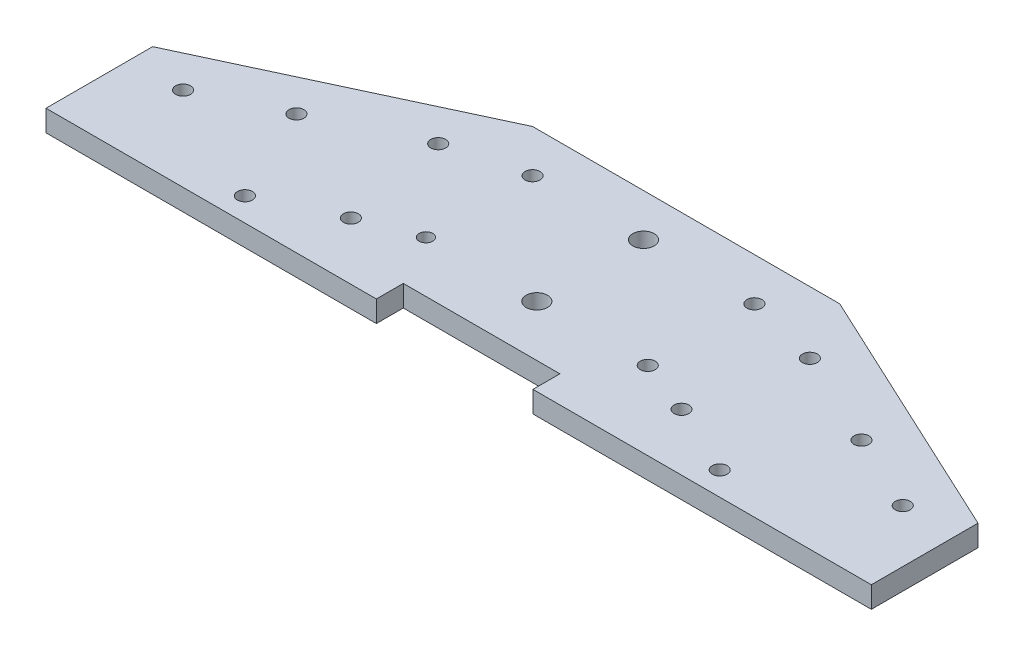
ISO-10303-21;
HEADER;
FILE_DESCRIPTION(('STEP AP214'),'2;1');
FILE_NAME('part.step','',(''),(''),'','','');
FILE_SCHEMA(('AUTOMOTIVE_DESIGN { 1 0 10303 214 1 1 1 1 }'));
ENDSEC;
DATA;
#1=APPLICATION_CONTEXT('core data for automotive mechanical design processes');
#2=APPLICATION_PROTOCOL_DEFINITION('international standard','automotive_design',2000,#1);
#3=PRODUCT_CONTEXT('',#1,'mechanical');
#4=PRODUCT('Part','Part','',(#3));
#5=PRODUCT_RELATED_PRODUCT_CATEGORY('part','',(#4));
#6=PRODUCT_DEFINITION_FORMATION('','',#4);
#7=PRODUCT_DEFINITION_CONTEXT('part definition',#1,'design');
#8=PRODUCT_DEFINITION('design','',#6,#7);
#9=PRODUCT_DEFINITION_SHAPE('','',#8);
#10=(LENGTH_UNIT() NAMED_UNIT(*) SI_UNIT(.MILLI.,.METRE.));
#11=(NAMED_UNIT(*) PLANE_ANGLE_UNIT() SI_UNIT($,.RADIAN.));
#12=(NAMED_UNIT(*) SI_UNIT($,.STERADIAN.) SOLID_ANGLE_UNIT());
#13=UNCERTAINTY_MEASURE_WITH_UNIT(LENGTH_MEASURE(1.E-05),#10,'distance_accuracy_value','');
#14=(GEOMETRIC_REPRESENTATION_CONTEXT(3) GLOBAL_UNCERTAINTY_ASSIGNED_CONTEXT((#13)) GLOBAL_UNIT_ASSIGNED_CONTEXT((#10,
#11,#12)) REPRESENTATION_CONTEXT('',''));
#15=CARTESIAN_POINT('',(0.,0.,0.));
#16=DIRECTION('',(0.,0.,1.));
#17=DIRECTION('',(1.,0.,0.));
#18=AXIS2_PLACEMENT_3D('',#15,#16,#17);
#19=CARTESIAN_POINT('',(-96.7226217314555,5.,53.315423536627));
#20=DIRECTION('',(0.,0.,-1.));
#21=DIRECTION('',(-1.,0.,0.));
#22=AXIS2_PLACEMENT_3D('',#19,#20,#21);
#23=PLANE('',#22);
#24=DIRECTION('',(1.,0.,0.));
#25=VECTOR('',#24,1.);
#26=CARTESIAN_POINT('',(-96.7226217314555,0.,53.315423536627));
#27=LINE('',#26,#25);
#28=CARTESIAN_POINT('',(-96.7226217314555,0.,53.315423536627));
#29=VERTEX_POINT('',#28);
#30=CARTESIAN_POINT('',(-19.2910247341421,0.,53.315423536627));
#31=VERTEX_POINT('',#30);
#32=EDGE_CURVE('E140',#29,#31,#27,.T.);
#33=ORIENTED_EDGE('',*,*,#32,.T.);
#34=DIRECTION('',(0.,1.,0.));
#35=VECTOR('',#34,1.);
#36=CARTESIAN_POINT('',(-19.2910247341421,-5.,53.315423536627));
#37=LINE('',#36,#35);
#38=CARTESIAN_POINT('',(-19.2910247341421,5.,53.315423536627));
#39=VERTEX_POINT('',#38);
#40=EDGE_CURVE('E191',#31,#39,#37,.T.);
#41=ORIENTED_EDGE('',*,*,#40,.T.);
#42=DIRECTION('',(1.,0.,0.));
#43=VECTOR('',#42,1.);
#44=CARTESIAN_POINT('',(-96.7226217314555,5.,53.315423536627));
#45=LINE('',#44,#43);
#46=CARTESIAN_POINT('',(-96.7226217314555,5.,53.315423536627));
#47=VERTEX_POINT('',#46);
#48=EDGE_CURVE('E95',#47,#39,#45,.T.);
#49=ORIENTED_EDGE('',*,*,#48,.F.);
#50=DIRECTION('',(0.,-1.,0.));
#51=VECTOR('',#50,1.);
#52=CARTESIAN_POINT('',(-96.7226217314555,5.,53.315423536627));
#53=LINE('',#52,#51);
#54=EDGE_CURVE('E156',#47,#29,#53,.T.);
#55=ORIENTED_EDGE('',*,*,#54,.T.);
#56=EDGE_LOOP('',(#33,#41,#49,#55));
#57=FACE_BOUND('',#56,.T.);
#58=ADVANCED_FACE('F35',(#57),#23,.F.);
#59=CARTESIAN_POINT('',(-96.7226217314555,5.,28.315423536627));
#60=DIRECTION('',(1.,0.,0.));
#61=DIRECTION('',(0.,0.,-1.));
#62=AXIS2_PLACEMENT_3D('',#59,#60,#61);
#63=PLANE('',#62);
#64=DIRECTION('',(0.,0.,1.));
#65=VECTOR('',#64,1.);
#66=CARTESIAN_POINT('',(-96.7226217314555,0.,28.315423536627));
#67=LINE('',#66,#65);
#68=CARTESIAN_POINT('',(-96.7226217314555,0.,28.315423536627));
#69=VERTEX_POINT('',#68);
#70=EDGE_CURVE('E135',#69,#29,#67,.T.);
#71=ORIENTED_EDGE('',*,*,#70,.T.);
#72=ORIENTED_EDGE('',*,*,#54,.F.);
#73=DIRECTION('',(0.,0.,1.));
#74=VECTOR('',#73,1.);
#75=CARTESIAN_POINT('',(-96.7226217314555,5.,28.315423536627));
#76=LINE('',#75,#74);
#77=CARTESIAN_POINT('',(-96.7226217314555,5.,28.315423536627));
#78=VERTEX_POINT('',#77);
#79=EDGE_CURVE('E149',#78,#47,#76,.T.);
#80=ORIENTED_EDGE('',*,*,#79,.F.);
#81=DIRECTION('',(0.,-1.,0.));
#82=VECTOR('',#81,1.);
#83=CARTESIAN_POINT('',(-96.7226217314555,5.,28.315423536627));
#84=LINE('',#83,#82);
#85=EDGE_CURVE('E131',#78,#69,#84,.T.);
#86=ORIENTED_EDGE('',*,*,#85,.T.);
#87=EDGE_LOOP('',(#71,#72,#80,#86));
#88=FACE_BOUND('',#87,.T.);
#89=ADVANCED_FACE('F37',(#88),#63,.F.);
#90=CARTESIAN_POINT('',(17.4089752659081,5.,53.315423536627));
#91=VERTEX_POINT('',#90);
#92=CARTESIAN_POINT('',(96.7226217314557,5.,53.315423536627));
#93=VERTEX_POINT('',#92);
#94=EDGE_CURVE('E285',#91,#93,#45,.T.);
#95=ORIENTED_EDGE('',*,*,#94,.F.);
#96=DIRECTION('',(0.,1.,0.));
#97=VECTOR('',#96,1.);
#98=CARTESIAN_POINT('',(17.4089752659081,-5.,53.315423536627));
#99=LINE('',#98,#97);
#100=CARTESIAN_POINT('',(17.4089752659081,0.,53.315423536627));
#101=VERTEX_POINT('',#100);
#102=EDGE_CURVE('E184',#101,#91,#99,.T.);
#103=ORIENTED_EDGE('',*,*,#102,.F.);
#104=CARTESIAN_POINT('',(96.7226217314557,0.,53.315423536627));
#105=VERTEX_POINT('',#104);
#106=EDGE_CURVE('E138',#101,#105,#27,.T.);
#107=ORIENTED_EDGE('',*,*,#106,.T.);
#108=DIRECTION('',(0.,-1.,0.));
#109=VECTOR('',#108,1.);
#110=CARTESIAN_POINT('',(96.7226217314557,5.,53.315423536627));
#111=LINE('',#110,#109);
#112=EDGE_CURVE('E153',#93,#105,#111,.T.);
#113=ORIENTED_EDGE('',*,*,#112,.F.);
#114=EDGE_LOOP('',(#95,#103,#107,#113));
#115=FACE_BOUND('',#114,.T.);
#116=ADVANCED_FACE('F294',(#115),#23,.F.);
#117=CARTESIAN_POINT('',(96.7226217314557,5.,53.315423536627));
#118=DIRECTION('',(-1.,0.,0.));
#119=DIRECTION('',(0.,0.,1.));
#120=AXIS2_PLACEMENT_3D('',#117,#118,#119);
#121=PLANE('',#120);
#122=DIRECTION('',(0.,0.,-1.));
#123=VECTOR('',#122,1.);
#124=CARTESIAN_POINT('',(96.7226217314557,0.,53.315423536627));
#125=LINE('',#124,#123);
#126=CARTESIAN_POINT('',(96.7226217314557,0.,28.3154235366264));
#127=VERTEX_POINT('',#126);
#128=EDGE_CURVE('E143',#105,#127,#125,.T.);
#129=ORIENTED_EDGE('',*,*,#128,.T.);
#130=DIRECTION('',(0.,-1.,0.));
#131=VECTOR('',#130,1.);
#132=CARTESIAN_POINT('',(96.7226217314557,5.,28.3154235366264));
#133=LINE('',#132,#131);
#134=CARTESIAN_POINT('',(96.7226217314557,5.,28.3154235366264));
#135=VERTEX_POINT('',#134);
#136=EDGE_CURVE('E126',#135,#127,#133,.T.);
#137=ORIENTED_EDGE('',*,*,#136,.F.);
#138=DIRECTION('',(0.,0.,-1.));
#139=VECTOR('',#138,1.);
#140=CARTESIAN_POINT('',(96.7226217314557,5.,53.315423536627));
#141=LINE('',#140,#139);
#142=EDGE_CURVE('E114',#93,#135,#141,.T.);
#143=ORIENTED_EDGE('',*,*,#142,.F.);
#144=ORIENTED_EDGE('',*,*,#112,.T.);
#145=EDGE_LOOP('',(#129,#137,#143,#144));
#146=FACE_BOUND('',#145,.T.);
#147=ADVANCED_FACE('F297',(#146),#121,.F.);
#148=CARTESIAN_POINT('',(36.,5.,0.));
#149=DIRECTION('',(-0.422618261740693,0.,0.906307787036653));
#150=DIRECTION('',(0.906307787036653,0.,0.422618261740693));
#151=AXIS2_PLACEMENT_3D('',#148,#149,#150);
#152=PLANE('',#151);
#153=DIRECTION('',(-0.906307787036653,0.,-0.422618261740693));
#154=VECTOR('',#153,1.);
#155=CARTESIAN_POINT('',(36.,0.,0.));
#156=LINE('',#155,#154);
#157=CARTESIAN_POINT('',(36.,0.,0.));
#158=VERTEX_POINT('',#157);
#159=EDGE_CURVE('E123',#127,#158,#156,.T.);
#160=ORIENTED_EDGE('',*,*,#159,.T.);
#161=DIRECTION('',(0.,-1.,0.));
#162=VECTOR('',#161,1.);
#163=CARTESIAN_POINT('',(36.,5.,0.));
#164=LINE('',#163,#162);
#165=CARTESIAN_POINT('',(36.,5.,0.));
#166=VERTEX_POINT('',#165);
#167=EDGE_CURVE('E120',#166,#158,#164,.T.);
#168=ORIENTED_EDGE('',*,*,#167,.F.);
#169=DIRECTION('',(-0.906307787036653,0.,-0.422618261740693));
#170=VECTOR('',#169,1.);
#171=CARTESIAN_POINT('',(36.,5.,0.));
#172=LINE('',#171,#170);
#173=EDGE_CURVE('E105',#135,#166,#172,.T.);
#174=ORIENTED_EDGE('',*,*,#173,.F.);
#175=ORIENTED_EDGE('',*,*,#136,.T.);
#176=EDGE_LOOP('',(#160,#168,#174,#175));
#177=FACE_BOUND('',#176,.T.);
#178=ADVANCED_FACE('F121',(#177),#152,.F.);
#179=CARTESIAN_POINT('',(36.,5.,0.));
#180=DIRECTION('',(0.,0.,1.));
#181=DIRECTION('',(1.,0.,0.));
#182=AXIS2_PLACEMENT_3D('',#179,#180,#181);
#183=PLANE('',#182);
#184=DIRECTION('',(-1.,0.,0.));
#185=VECTOR('',#184,1.);
#186=CARTESIAN_POINT('',(36.,0.,0.));
#187=LINE('',#186,#185);
#188=CARTESIAN_POINT('',(-36.,0.,0.));
#189=VERTEX_POINT('',#188);
#190=EDGE_CURVE('E146',#158,#189,#187,.T.);
#191=ORIENTED_EDGE('',*,*,#190,.T.);
#192=DIRECTION('',(0.,-1.,0.));
#193=VECTOR('',#192,1.);
#194=CARTESIAN_POINT('',(-36.,5.,0.));
#195=LINE('',#194,#193);
#196=CARTESIAN_POINT('',(-36.,5.,0.));
#197=VERTEX_POINT('',#196);
#198=EDGE_CURVE('E127',#197,#189,#195,.T.);
#199=ORIENTED_EDGE('',*,*,#198,.F.);
#200=DIRECTION('',(-1.,0.,0.));
#201=VECTOR('',#200,1.);
#202=CARTESIAN_POINT('',(36.,5.,0.));
#203=LINE('',#202,#201);
#204=EDGE_CURVE('E111',#166,#197,#203,.T.);
#205=ORIENTED_EDGE('',*,*,#204,.F.);
#206=ORIENTED_EDGE('',*,*,#167,.T.);
#207=EDGE_LOOP('',(#191,#199,#205,#206));
#208=FACE_BOUND('',#207,.T.);
#209=ADVANCED_FACE('F129',(#208),#183,.F.);
#210=CARTESIAN_POINT('',(-36.,5.,0.));
#211=DIRECTION('',(0.422618261740701,0.,0.906307787036649));
#212=DIRECTION('',(0.906307787036649,0.,-0.422618261740701));
#213=AXIS2_PLACEMENT_3D('',#210,#211,#212);
#214=PLANE('',#213);
#215=DIRECTION('',(-0.906307787036649,0.,0.422618261740701));
#216=VECTOR('',#215,1.);
#217=CARTESIAN_POINT('',(-36.,0.,0.));
#218=LINE('',#217,#216);
#219=EDGE_CURVE('E86',#189,#69,#218,.T.);
#220=ORIENTED_EDGE('',*,*,#219,.T.);
#221=ORIENTED_EDGE('',*,*,#85,.F.);
#222=DIRECTION('',(-0.906307787036649,0.,0.422618261740701));
#223=VECTOR('',#222,1.);
#224=CARTESIAN_POINT('',(-36.,5.,0.));
#225=LINE('',#224,#223);
#226=EDGE_CURVE('E59',#197,#78,#225,.T.);
#227=ORIENTED_EDGE('',*,*,#226,.F.);
#228=ORIENTED_EDGE('',*,*,#198,.T.);
#229=EDGE_LOOP('',(#220,#221,#227,#228));
#230=FACE_BOUND('',#229,.T.);
#231=ADVANCED_FACE('F299',(#230),#214,.F.);
#232=CARTESIAN_POINT('',(0.,5.,0.));
#233=DIRECTION('',(0.,1.,0.));
#234=DIRECTION('',(0.,0.,1.));
#235=AXIS2_PLACEMENT_3D('',#232,#233,#234);
#236=PLANE('',#235);
#237=DIRECTION('',(0.,0.,1.));
#238=VECTOR('',#237,1.);
#239=CARTESIAN_POINT('',(-19.2910247341421,5.,53.315423536627));
#240=LINE('',#239,#238);
#241=CARTESIAN_POINT('',(-19.2910247341421,5.,46.999999999999));
#242=VERTEX_POINT('',#241);
#243=EDGE_CURVE('E309',#242,#39,#240,.T.);
#244=ORIENTED_EDGE('',*,*,#243,.F.);
#245=DIRECTION('',(-1.,0.,0.));
#246=VECTOR('',#245,1.);
#247=CARTESIAN_POINT('',(-19.2910247341421,5.,46.999999999999));
#248=LINE('',#247,#246);
#249=CARTESIAN_POINT('',(17.4089752659081,5.,46.999999999999));
#250=VERTEX_POINT('',#249);
#251=EDGE_CURVE('E176',#250,#242,#248,.T.);
#252=ORIENTED_EDGE('',*,*,#251,.F.);
#253=DIRECTION('',(0.,0.,-1.));
#254=VECTOR('',#253,1.);
#255=CARTESIAN_POINT('',(17.4089752659081,5.,53.315423536627));
#256=LINE('',#255,#254);
#257=EDGE_CURVE('E291',#91,#250,#256,.T.);
#258=ORIENTED_EDGE('',*,*,#257,.F.);
#259=ORIENTED_EDGE('',*,*,#94,.T.);
#260=ORIENTED_EDGE('',*,*,#142,.T.);
#261=ORIENTED_EDGE('',*,*,#173,.T.);
#262=ORIENTED_EDGE('',*,*,#204,.T.);
#263=ORIENTED_EDGE('',*,*,#226,.T.);
#264=ORIENTED_EDGE('',*,*,#79,.T.);
#265=ORIENTED_EDGE('',*,*,#48,.T.);
#266=EDGE_LOOP('',(#244,#252,#258,#259,#260,#261,#262,#263,#264,#265));
#267=FACE_BOUND('',#266,.T.);
#268=CARTESIAN_POINT('',(-84.3396690307186,5.,33.5749370513272));
#269=DIRECTION('',(0.,1.,0.));
#270=DIRECTION('',(0.,0.,1.));
#271=AXIS2_PLACEMENT_3D('',#268,#269,#270);
#272=CIRCLE('',#271,1.75000000000001);
#273=CARTESIAN_POINT('',(-84.3396690307186,5.,35.3249370513272));
#274=VERTEX_POINT('',#273);
#275=EDGE_CURVE('E193',#274,#274,#272,.T.);
#276=ORIENTED_EDGE('',*,*,#275,.F.);
#277=EDGE_LOOP('',(#276));
#278=FACE_BOUND('',#277,.T.);
#279=CARTESIAN_POINT('',(26.,5.,10.));
#280=DIRECTION('',(0.,1.,0.));
#281=DIRECTION('',(0.,0.,1.));
#282=AXIS2_PLACEMENT_3D('',#279,#280,#281);
#283=CIRCLE('',#282,1.74999999999999);
#284=CARTESIAN_POINT('',(26.,5.,11.75));
#285=VERTEX_POINT('',#284);
#286=EDGE_CURVE('E209',#285,#285,#283,.T.);
#287=ORIENTED_EDGE('',*,*,#286,.F.);
#288=EDGE_LOOP('',(#287));
#289=FACE_BOUND('',#288,.T.);
#290=CARTESIAN_POINT('',(0.,5.,35.));
#291=DIRECTION('',(0.,1.,0.));
#292=DIRECTION('',(0.,0.,1.));
#293=AXIS2_PLACEMENT_3D('',#290,#291,#292);
#294=CIRCLE('',#293,2.5);
#295=CARTESIAN_POINT('',(0.,5.,37.5));
#296=VERTEX_POINT('',#295);
#297=EDGE_CURVE('E214',#296,#296,#294,.T.);
#298=ORIENTED_EDGE('',*,*,#297,.F.);
#299=EDGE_LOOP('',(#298));
#300=FACE_BOUND('',#299,.T.);
#301=CARTESIAN_POINT('',(0.,5.,10.));
#302=DIRECTION('',(0.,1.,0.));
#303=DIRECTION('',(0.,0.,1.));
#304=AXIS2_PLACEMENT_3D('',#301,#302,#303);
#305=CIRCLE('',#304,2.5);
#306=CARTESIAN_POINT('',(0.,5.,12.5));
#307=VERTEX_POINT('',#306);
#308=EDGE_CURVE('E221',#307,#307,#305,.T.);
#309=ORIENTED_EDGE('',*,*,#308,.F.);
#310=EDGE_LOOP('',(#309));
#311=FACE_BOUND('',#310,.T.);
#312=CARTESIAN_POINT('',(43.5558186140695,5.,14.5571152729955));
#313=DIRECTION('',(0.,1.,0.));
#314=DIRECTION('',(0.,0.,1.));
#315=AXIS2_PLACEMENT_3D('',#312,#313,#314);
#316=CIRCLE('',#315,1.75);
#317=CARTESIAN_POINT('',(43.5558186140695,5.,16.3071152729955));
#318=VERTEX_POINT('',#317);
#319=EDGE_CURVE('E226',#318,#318,#316,.T.);
#320=ORIENTED_EDGE('',*,*,#319,.F.);
#321=EDGE_LOOP('',(#320));
#322=FACE_BOUND('',#321,.T.);
#323=CARTESIAN_POINT('',(-26.,5.,35.));
#324=DIRECTION('',(0.,1.,0.));
#325=DIRECTION('',(0.,0.,1.));
#326=AXIS2_PLACEMENT_3D('',#323,#324,#325);
#327=CIRCLE('',#326,1.59924683851209);
#328=CARTESIAN_POINT('',(-26.,5.,36.5992468385121));
#329=VERTEX_POINT('',#328);
#330=EDGE_CURVE('E179',#329,#329,#327,.T.);
#331=ORIENTED_EDGE('',*,*,#330,.F.);
#332=EDGE_LOOP('',(#331));
#333=FACE_BOUND('',#332,.T.);
#334=CARTESIAN_POINT('',(-26.,5.,10.));
#335=DIRECTION('',(0.,1.,0.));
#336=DIRECTION('',(0.,0.,1.));
#337=AXIS2_PLACEMENT_3D('',#334,#335,#336);
#338=CIRCLE('',#337,1.75);
#339=CARTESIAN_POINT('',(-26.,5.,11.75));
#340=VERTEX_POINT('',#339);
#341=EDGE_CURVE('E201',#340,#340,#338,.T.);
#342=ORIENTED_EDGE('',*,*,#341,.F.);
#343=EDGE_LOOP('',(#342));
#344=FACE_BOUND('',#343,.T.);
#345=CARTESIAN_POINT('',(26.,5.,35.));
#346=DIRECTION('',(0.,1.,0.));
#347=DIRECTION('',(0.,0.,1.));
#348=AXIS2_PLACEMENT_3D('',#345,#346,#347);
#349=CIRCLE('',#348,1.74999999999999);
#350=CARTESIAN_POINT('',(26.,5.,36.75));
#351=VERTEX_POINT('',#350);
#352=EDGE_CURVE('E202',#351,#351,#349,.T.);
#353=ORIENTED_EDGE('',*,*,#352,.F.);
#354=EDGE_LOOP('',(#353));
#355=FACE_BOUND('',#354,.T.);
#356=CARTESIAN_POINT('',(66.2135132899859,5.,25.1225718165129));
#357=DIRECTION('',(0.,1.,0.));
#358=DIRECTION('',(0.,0.,1.));
#359=AXIS2_PLACEMENT_3D('',#356,#357,#358);
#360=CIRCLE('',#359,1.75000000000001);
#361=CARTESIAN_POINT('',(66.2135132899859,5.,26.8725718165129));
#362=VERTEX_POINT('',#361);
#363=EDGE_CURVE('E233',#362,#362,#360,.T.);
#364=ORIENTED_EDGE('',*,*,#363,.F.);
#365=EDGE_LOOP('',(#364));
#366=FACE_BOUND('',#365,.T.);
#367=CARTESIAN_POINT('',(84.3396690307189,5.,33.5749370513267));
#368=DIRECTION('',(0.,1.,0.));
#369=DIRECTION('',(0.,0.,1.));
#370=AXIS2_PLACEMENT_3D('',#367,#368,#369);
#371=CIRCLE('',#370,1.75);
#372=CARTESIAN_POINT('',(84.3396690307189,5.,35.3249370513267));
#373=VERTEX_POINT('',#372);
#374=EDGE_CURVE('E274',#373,#373,#371,.T.);
#375=ORIENTED_EDGE('',*,*,#374,.F.);
#376=EDGE_LOOP('',(#375));
#377=FACE_BOUND('',#376,.T.);
#378=CARTESIAN_POINT('',(55.6480567464685,5.,47.7802664924292));
#379=DIRECTION('',(0.,1.,0.));
#380=DIRECTION('',(0.,0.,1.));
#381=AXIS2_PLACEMENT_3D('',#378,#379,#380);
#382=CIRCLE('',#381,1.75);
#383=CARTESIAN_POINT('',(55.6480567464685,5.,49.5302664924292));
#384=VERTEX_POINT('',#383);
#385=EDGE_CURVE('E268',#384,#384,#382,.T.);
#386=ORIENTED_EDGE('',*,*,#385,.F.);
#387=EDGE_LOOP('',(#386));
#388=FACE_BOUND('',#387,.T.);
#389=CARTESIAN_POINT('',(38.8688734566831,5.,39.956004826816));
#390=DIRECTION('',(0.,1.,0.));
#391=DIRECTION('',(0.,0.,1.));
#392=AXIS2_PLACEMENT_3D('',#389,#390,#391);
#393=CIRCLE('',#392,1.75);
#394=CARTESIAN_POINT('',(38.8688734566831,5.,41.706004826816));
#395=VERTEX_POINT('',#394);
#396=EDGE_CURVE('E262',#395,#395,#393,.T.);
#397=ORIENTED_EDGE('',*,*,#396,.F.);
#398=EDGE_LOOP('',(#397));
#399=FACE_BOUND('',#398,.T.);
#400=CARTESIAN_POINT('',(-43.5558186140694,5.,14.5571152729956));
#401=DIRECTION('',(0.,1.,0.));
#402=DIRECTION('',(0.,0.,1.));
#403=AXIS2_PLACEMENT_3D('',#400,#401,#402);
#404=CIRCLE('',#403,1.75000000000001);
#405=CARTESIAN_POINT('',(-43.5558186140694,5.,16.3071152729957));
#406=VERTEX_POINT('',#405);
#407=EDGE_CURVE('E256',#406,#406,#404,.T.);
#408=ORIENTED_EDGE('',*,*,#407,.F.);
#409=EDGE_LOOP('',(#408));
#410=FACE_BOUND('',#409,.T.);
#411=CARTESIAN_POINT('',(-38.701346440772,5.,39.877885696349));
#412=DIRECTION('',(0.,1.,0.));
#413=DIRECTION('',(0.,0.,1.));
#414=AXIS2_PLACEMENT_3D('',#411,#412,#413);
#415=CIRCLE('',#414,1.75000000000001);
#416=CARTESIAN_POINT('',(-38.701346440772,5.,41.627885696349));
#417=VERTEX_POINT('',#416);
#418=EDGE_CURVE('E250',#417,#417,#415,.T.);
#419=ORIENTED_EDGE('',*,*,#418,.F.);
#420=EDGE_LOOP('',(#419));
#421=FACE_BOUND('',#420,.T.);
#422=CARTESIAN_POINT('',(-55.6480567464681,5.,47.7802664924294));
#423=DIRECTION('',(0.,1.,0.));
#424=DIRECTION('',(0.,0.,1.));
#425=AXIS2_PLACEMENT_3D('',#422,#423,#424);
#426=CIRCLE('',#425,1.75);
#427=CARTESIAN_POINT('',(-55.6480567464681,5.,49.5302664924294));
#428=VERTEX_POINT('',#427);
#429=EDGE_CURVE('E244',#428,#428,#426,.T.);
#430=ORIENTED_EDGE('',*,*,#429,.F.);
#431=EDGE_LOOP('',(#430));
#432=FACE_BOUND('',#431,.T.);
#433=CARTESIAN_POINT('',(-66.2135132899856,5.,25.1225718165132));
#434=DIRECTION('',(0.,1.,0.));
#435=DIRECTION('',(0.,0.,1.));
#436=AXIS2_PLACEMENT_3D('',#433,#434,#435);
#437=CIRCLE('',#436,1.75000000000001);
#438=CARTESIAN_POINT('',(-66.2135132899856,5.,26.8725718165132));
#439=VERTEX_POINT('',#438);
#440=EDGE_CURVE('E238',#439,#439,#437,.T.);
#441=ORIENTED_EDGE('',*,*,#440,.F.);
#442=EDGE_LOOP('',(#441));
#443=FACE_BOUND('',#442,.T.);
#444=ADVANCED_FACE('F108',(#267,#278,#289,#300,#311,#322,#333,#344,#355,#366,#377,#388,#399,
#410,#421,#432,#443),#236,.T.);
#445=CARTESIAN_POINT('',(0.,0.,0.));
#446=DIRECTION('',(0.,1.,0.));
#447=DIRECTION('',(0.,0.,1.));
#448=AXIS2_PLACEMENT_3D('',#445,#446,#447);
#449=PLANE('',#448);
#450=CARTESIAN_POINT('',(-84.3396690307186,0.,33.5749370513272));
#451=DIRECTION('',(0.,1.,0.));
#452=DIRECTION('',(0.,0.,1.));
#453=AXIS2_PLACEMENT_3D('',#450,#451,#452);
#454=CIRCLE('',#453,1.75000000000001);
#455=CARTESIAN_POINT('',(-84.3396690307186,0.,35.3249370513272));
#456=VERTEX_POINT('',#455);
#457=EDGE_CURVE('E139',#456,#456,#454,.F.);
#458=ORIENTED_EDGE('',*,*,#457,.F.);
#459=EDGE_LOOP('',(#458));
#460=FACE_BOUND('',#459,.T.);
#461=CARTESIAN_POINT('',(26.,0.,10.));
#462=DIRECTION('',(0.,1.,0.));
#463=DIRECTION('',(0.,0.,1.));
#464=AXIS2_PLACEMENT_3D('',#461,#462,#463);
#465=CIRCLE('',#464,1.74999999999999);
#466=CARTESIAN_POINT('',(26.,0.,11.75));
#467=VERTEX_POINT('',#466);
#468=EDGE_CURVE('E218',#467,#467,#465,.F.);
#469=ORIENTED_EDGE('',*,*,#468,.F.);
#470=EDGE_LOOP('',(#469));
#471=FACE_BOUND('',#470,.T.);
#472=CARTESIAN_POINT('',(0.,0.,35.));
#473=DIRECTION('',(0.,1.,0.));
#474=DIRECTION('',(0.,0.,1.));
#475=AXIS2_PLACEMENT_3D('',#472,#473,#474);
#476=CIRCLE('',#475,2.5);
#477=CARTESIAN_POINT('',(0.,0.,37.5));
#478=VERTEX_POINT('',#477);
#479=EDGE_CURVE('E217',#478,#478,#476,.F.);
#480=ORIENTED_EDGE('',*,*,#479,.F.);
#481=EDGE_LOOP('',(#480));
#482=FACE_BOUND('',#481,.T.);
#483=CARTESIAN_POINT('',(0.,0.,10.));
#484=DIRECTION('',(0.,1.,0.));
#485=DIRECTION('',(0.,0.,1.));
#486=AXIS2_PLACEMENT_3D('',#483,#484,#485);
#487=CIRCLE('',#486,2.5);
#488=CARTESIAN_POINT('',(0.,0.,12.5));
#489=VERTEX_POINT('',#488);
#490=EDGE_CURVE('E230',#489,#489,#487,.F.);
#491=ORIENTED_EDGE('',*,*,#490,.F.);
#492=EDGE_LOOP('',(#491));
#493=FACE_BOUND('',#492,.T.);
#494=CARTESIAN_POINT('',(43.5558186140695,0.,14.5571152729955));
#495=DIRECTION('',(0.,1.,0.));
#496=DIRECTION('',(0.,0.,1.));
#497=AXIS2_PLACEMENT_3D('',#494,#495,#496);
#498=CIRCLE('',#497,1.75);
#499=CARTESIAN_POINT('',(43.5558186140695,0.,16.3071152729955));
#500=VERTEX_POINT('',#499);
#501=EDGE_CURVE('E229',#500,#500,#498,.F.);
#502=ORIENTED_EDGE('',*,*,#501,.F.);
#503=EDGE_LOOP('',(#502));
#504=FACE_BOUND('',#503,.T.);
#505=CARTESIAN_POINT('',(-26.,0.,35.));
#506=DIRECTION('',(0.,1.,0.));
#507=DIRECTION('',(0.,0.,1.));
#508=AXIS2_PLACEMENT_3D('',#505,#506,#507);
#509=CIRCLE('',#508,1.59924683851209);
#510=CARTESIAN_POINT('',(-26.,0.,36.5992468385121));
#511=VERTEX_POINT('',#510);
#512=EDGE_CURVE('E182',#511,#511,#509,.F.);
#513=ORIENTED_EDGE('',*,*,#512,.F.);
#514=EDGE_LOOP('',(#513));
#515=FACE_BOUND('',#514,.T.);
#516=CARTESIAN_POINT('',(-26.,0.,10.));
#517=DIRECTION('',(0.,1.,0.));
#518=DIRECTION('',(0.,0.,1.));
#519=AXIS2_PLACEMENT_3D('',#516,#517,#518);
#520=CIRCLE('',#519,1.75);
#521=CARTESIAN_POINT('',(-26.,0.,11.75));
#522=VERTEX_POINT('',#521);
#523=EDGE_CURVE('E206',#522,#522,#520,.F.);
#524=ORIENTED_EDGE('',*,*,#523,.F.);
#525=EDGE_LOOP('',(#524));
#526=FACE_BOUND('',#525,.T.);
#527=CARTESIAN_POINT('',(26.,0.,35.));
#528=DIRECTION('',(0.,1.,0.));
#529=DIRECTION('',(0.,0.,1.));
#530=AXIS2_PLACEMENT_3D('',#527,#528,#529);
#531=CIRCLE('',#530,1.74999999999999);
#532=CARTESIAN_POINT('',(26.,0.,36.75));
#533=VERTEX_POINT('',#532);
#534=EDGE_CURVE('E205',#533,#533,#531,.F.);
#535=ORIENTED_EDGE('',*,*,#534,.F.);
#536=EDGE_LOOP('',(#535));
#537=FACE_BOUND('',#536,.T.);
#538=CARTESIAN_POINT('',(66.2135132899859,0.,25.1225718165129));
#539=DIRECTION('',(0.,1.,0.));
#540=DIRECTION('',(0.,0.,1.));
#541=AXIS2_PLACEMENT_3D('',#538,#539,#540);
#542=CIRCLE('',#541,1.75000000000001);
#543=CARTESIAN_POINT('',(66.2135132899859,0.,26.8725718165129));
#544=VERTEX_POINT('',#543);
#545=EDGE_CURVE('E277',#544,#544,#542,.F.);
#546=ORIENTED_EDGE('',*,*,#545,.F.);
#547=EDGE_LOOP('',(#546));
#548=FACE_BOUND('',#547,.T.);
#549=CARTESIAN_POINT('',(84.3396690307189,0.,33.5749370513267));
#550=DIRECTION('',(0.,1.,0.));
#551=DIRECTION('',(0.,0.,1.));
#552=AXIS2_PLACEMENT_3D('',#549,#550,#551);
#553=CIRCLE('',#552,1.75);
#554=CARTESIAN_POINT('',(84.3396690307189,0.,35.3249370513267));
#555=VERTEX_POINT('',#554);
#556=EDGE_CURVE('E271',#555,#555,#553,.F.);
#557=ORIENTED_EDGE('',*,*,#556,.F.);
#558=EDGE_LOOP('',(#557));
#559=FACE_BOUND('',#558,.T.);
#560=CARTESIAN_POINT('',(55.6480567464685,0.,47.7802664924292));
#561=DIRECTION('',(0.,1.,0.));
#562=DIRECTION('',(0.,0.,1.));
#563=AXIS2_PLACEMENT_3D('',#560,#561,#562);
#564=CIRCLE('',#563,1.75);
#565=CARTESIAN_POINT('',(55.6480567464685,0.,49.5302664924292));
#566=VERTEX_POINT('',#565);
#567=EDGE_CURVE('E265',#566,#566,#564,.F.);
#568=ORIENTED_EDGE('',*,*,#567,.F.);
#569=EDGE_LOOP('',(#568));
#570=FACE_BOUND('',#569,.T.);
#571=CARTESIAN_POINT('',(38.8688734566831,0.,39.956004826816));
#572=DIRECTION('',(0.,1.,0.));
#573=DIRECTION('',(0.,0.,1.));
#574=AXIS2_PLACEMENT_3D('',#571,#572,#573);
#575=CIRCLE('',#574,1.75);
#576=CARTESIAN_POINT('',(38.8688734566831,0.,41.706004826816));
#577=VERTEX_POINT('',#576);
#578=EDGE_CURVE('E259',#577,#577,#575,.F.);
#579=ORIENTED_EDGE('',*,*,#578,.F.);
#580=EDGE_LOOP('',(#579));
#581=FACE_BOUND('',#580,.T.);
#582=CARTESIAN_POINT('',(-43.5558186140694,0.,14.5571152729956));
#583=DIRECTION('',(0.,1.,0.));
#584=DIRECTION('',(0.,0.,1.));
#585=AXIS2_PLACEMENT_3D('',#582,#583,#584);
#586=CIRCLE('',#585,1.75000000000001);
#587=CARTESIAN_POINT('',(-43.5558186140694,0.,16.3071152729957));
#588=VERTEX_POINT('',#587);
#589=EDGE_CURVE('E253',#588,#588,#586,.F.);
#590=ORIENTED_EDGE('',*,*,#589,.F.);
#591=EDGE_LOOP('',(#590));
#592=FACE_BOUND('',#591,.T.);
#593=CARTESIAN_POINT('',(-38.701346440772,0.,39.877885696349));
#594=DIRECTION('',(0.,1.,0.));
#595=DIRECTION('',(0.,0.,1.));
#596=AXIS2_PLACEMENT_3D('',#593,#594,#595);
#597=CIRCLE('',#596,1.75000000000001);
#598=CARTESIAN_POINT('',(-38.701346440772,0.,41.627885696349));
#599=VERTEX_POINT('',#598);
#600=EDGE_CURVE('E247',#599,#599,#597,.F.);
#601=ORIENTED_EDGE('',*,*,#600,.F.);
#602=EDGE_LOOP('',(#601));
#603=FACE_BOUND('',#602,.T.);
#604=CARTESIAN_POINT('',(-55.6480567464681,0.,47.7802664924294));
#605=DIRECTION('',(0.,1.,0.));
#606=DIRECTION('',(0.,0.,1.));
#607=AXIS2_PLACEMENT_3D('',#604,#605,#606);
#608=CIRCLE('',#607,1.75);
#609=CARTESIAN_POINT('',(-55.6480567464681,0.,49.5302664924294));
#610=VERTEX_POINT('',#609);
#611=EDGE_CURVE('E241',#610,#610,#608,.F.);
#612=ORIENTED_EDGE('',*,*,#611,.F.);
#613=EDGE_LOOP('',(#612));
#614=FACE_BOUND('',#613,.T.);
#615=CARTESIAN_POINT('',(-66.2135132899856,0.,25.1225718165132));
#616=DIRECTION('',(0.,1.,0.));
#617=DIRECTION('',(0.,0.,1.));
#618=AXIS2_PLACEMENT_3D('',#615,#616,#617);
#619=CIRCLE('',#618,1.75000000000001);
#620=CARTESIAN_POINT('',(-66.2135132899856,0.,26.8725718165132));
#621=VERTEX_POINT('',#620);
#622=EDGE_CURVE('E196',#621,#621,#619,.F.);
#623=ORIENTED_EDGE('',*,*,#622,.F.);
#624=EDGE_LOOP('',(#623));
#625=FACE_BOUND('',#624,.T.);
#626=DIRECTION('',(-1.,0.,0.));
#627=VECTOR('',#626,1.);
#628=CARTESIAN_POINT('',(0.,0.,46.999999999999));
#629=LINE('',#628,#627);
#630=CARTESIAN_POINT('',(17.4089752659081,0.,46.999999999999));
#631=VERTEX_POINT('',#630);
#632=CARTESIAN_POINT('',(-19.2910247341421,0.,46.999999999999));
#633=VERTEX_POINT('',#632);
#634=EDGE_CURVE('E43',#631,#633,#629,.T.);
#635=ORIENTED_EDGE('',*,*,#634,.T.);
#636=DIRECTION('',(0.,0.,1.));
#637=VECTOR('',#636,1.);
#638=CARTESIAN_POINT('',(-19.2910247341421,0.,0.));
#639=LINE('',#638,#637);
#640=EDGE_CURVE('E11',#633,#31,#639,.T.);
#641=ORIENTED_EDGE('',*,*,#640,.T.);
#642=ORIENTED_EDGE('',*,*,#32,.F.);
#643=ORIENTED_EDGE('',*,*,#70,.F.);
#644=ORIENTED_EDGE('',*,*,#219,.F.);
#645=ORIENTED_EDGE('',*,*,#190,.F.);
#646=ORIENTED_EDGE('',*,*,#159,.F.);
#647=ORIENTED_EDGE('',*,*,#128,.F.);
#648=ORIENTED_EDGE('',*,*,#106,.F.);
#649=DIRECTION('',(0.,0.,-1.));
#650=VECTOR('',#649,1.);
#651=CARTESIAN_POINT('',(17.4089752659081,0.,0.));
#652=LINE('',#651,#650);
#653=EDGE_CURVE('E158',#101,#631,#652,.T.);
#654=ORIENTED_EDGE('',*,*,#653,.T.);
#655=EDGE_LOOP('',(#635,#641,#642,#643,#644,#645,#646,#647,#648,#654));
#656=FACE_BOUND('',#655,.T.);
#657=ADVANCED_FACE('F162',(#460,#471,#482,#493,#504,#515,#526,#537,#548,#559,#570,#581,#592,
#603,#614,#625,#656),#449,.F.);
#658=CARTESIAN_POINT('',(-66.2135132899856,-0.00100000000000013,25.1225718165132));
#659=DIRECTION('',(0.,1.,0.));
#660=DIRECTION('',(0.,0.,1.));
#661=AXIS2_PLACEMENT_3D('',#658,#659,#660);
#662=CYLINDRICAL_SURFACE('',#661,1.75000000000001);
#663=ORIENTED_EDGE('',*,*,#440,.T.);
#664=EDGE_LOOP('',(#663));
#665=FACE_BOUND('',#664,.T.);
#666=ORIENTED_EDGE('',*,*,#622,.T.);
#667=EDGE_LOOP('',(#666));
#668=FACE_BOUND('',#667,.T.);
#669=ADVANCED_FACE('F342',(#665,#668),#662,.F.);
#670=CARTESIAN_POINT('',(-55.6480567464681,-0.00100000000000013,47.7802664924294));
#671=DIRECTION('',(0.,1.,0.));
#672=DIRECTION('',(0.,0.,1.));
#673=AXIS2_PLACEMENT_3D('',#670,#671,#672);
#674=CYLINDRICAL_SURFACE('',#673,1.75);
#675=ORIENTED_EDGE('',*,*,#429,.T.);
#676=EDGE_LOOP('',(#675));
#677=FACE_BOUND('',#676,.T.);
#678=ORIENTED_EDGE('',*,*,#611,.T.);
#679=EDGE_LOOP('',(#678));
#680=FACE_BOUND('',#679,.T.);
#681=ADVANCED_FACE('F369',(#677,#680),#674,.F.);
#682=CARTESIAN_POINT('',(-38.701346440772,-0.00100000000000013,39.877885696349));
#683=DIRECTION('',(0.,1.,0.));
#684=DIRECTION('',(0.,0.,1.));
#685=AXIS2_PLACEMENT_3D('',#682,#683,#684);
#686=CYLINDRICAL_SURFACE('',#685,1.75000000000001);
#687=ORIENTED_EDGE('',*,*,#418,.T.);
#688=EDGE_LOOP('',(#687));
#689=FACE_BOUND('',#688,.T.);
#690=ORIENTED_EDGE('',*,*,#600,.T.);
#691=EDGE_LOOP('',(#690));
#692=FACE_BOUND('',#691,.T.);
#693=ADVANCED_FACE('F365',(#689,#692),#686,.F.);
#694=CARTESIAN_POINT('',(-43.5558186140694,-0.00100000000000013,14.5571152729956));
#695=DIRECTION('',(0.,1.,0.));
#696=DIRECTION('',(0.,0.,1.));
#697=AXIS2_PLACEMENT_3D('',#694,#695,#696);
#698=CYLINDRICAL_SURFACE('',#697,1.75000000000001);
#699=ORIENTED_EDGE('',*,*,#407,.T.);
#700=EDGE_LOOP('',(#699));
#701=FACE_BOUND('',#700,.T.);
#702=ORIENTED_EDGE('',*,*,#589,.T.);
#703=EDGE_LOOP('',(#702));
#704=FACE_BOUND('',#703,.T.);
#705=ADVANCED_FACE('F361',(#701,#704),#698,.F.);
#706=CARTESIAN_POINT('',(38.8688734566831,-0.00100000000000013,39.956004826816));
#707=DIRECTION('',(0.,1.,0.));
#708=DIRECTION('',(0.,0.,1.));
#709=AXIS2_PLACEMENT_3D('',#706,#707,#708);
#710=CYLINDRICAL_SURFACE('',#709,1.75);
#711=ORIENTED_EDGE('',*,*,#396,.T.);
#712=EDGE_LOOP('',(#711));
#713=FACE_BOUND('',#712,.T.);
#714=ORIENTED_EDGE('',*,*,#578,.T.);
#715=EDGE_LOOP('',(#714));
#716=FACE_BOUND('',#715,.T.);
#717=ADVANCED_FACE('F357',(#713,#716),#710,.F.);
#718=CARTESIAN_POINT('',(55.6480567464685,-0.00100000000000013,47.7802664924292));
#719=DIRECTION('',(0.,1.,0.));
#720=DIRECTION('',(0.,0.,1.));
#721=AXIS2_PLACEMENT_3D('',#718,#719,#720);
#722=CYLINDRICAL_SURFACE('',#721,1.75);
#723=ORIENTED_EDGE('',*,*,#385,.T.);
#724=EDGE_LOOP('',(#723));
#725=FACE_BOUND('',#724,.T.);
#726=ORIENTED_EDGE('',*,*,#567,.T.);
#727=EDGE_LOOP('',(#726));
#728=FACE_BOUND('',#727,.T.);
#729=ADVANCED_FACE('F353',(#725,#728),#722,.F.);
#730=CARTESIAN_POINT('',(84.3396690307189,-0.00100000000000013,33.5749370513267));
#731=DIRECTION('',(0.,1.,0.));
#732=DIRECTION('',(0.,0.,1.));
#733=AXIS2_PLACEMENT_3D('',#730,#731,#732);
#734=CYLINDRICAL_SURFACE('',#733,1.75);
#735=ORIENTED_EDGE('',*,*,#374,.T.);
#736=EDGE_LOOP('',(#735));
#737=FACE_BOUND('',#736,.T.);
#738=ORIENTED_EDGE('',*,*,#556,.T.);
#739=EDGE_LOOP('',(#738));
#740=FACE_BOUND('',#739,.T.);
#741=ADVANCED_FACE('F349',(#737,#740),#734,.F.);
#742=CARTESIAN_POINT('',(66.2135132899859,-0.00100000000000013,25.1225718165129));
#743=DIRECTION('',(0.,1.,0.));
#744=DIRECTION('',(0.,0.,1.));
#745=AXIS2_PLACEMENT_3D('',#742,#743,#744);
#746=CYLINDRICAL_SURFACE('',#745,1.75000000000001);
#747=ORIENTED_EDGE('',*,*,#363,.T.);
#748=EDGE_LOOP('',(#747));
#749=FACE_BOUND('',#748,.T.);
#750=ORIENTED_EDGE('',*,*,#545,.T.);
#751=EDGE_LOOP('',(#750));
#752=FACE_BOUND('',#751,.T.);
#753=ADVANCED_FACE('F345',(#749,#752),#746,.F.);
#754=CARTESIAN_POINT('',(26.,-0.00100000000000013,35.));
#755=DIRECTION('',(0.,1.,0.));
#756=DIRECTION('',(0.,0.,1.));
#757=AXIS2_PLACEMENT_3D('',#754,#755,#756);
#758=CYLINDRICAL_SURFACE('',#757,1.74999999999999);
#759=ORIENTED_EDGE('',*,*,#352,.T.);
#760=EDGE_LOOP('',(#759));
#761=FACE_BOUND('',#760,.T.);
#762=ORIENTED_EDGE('',*,*,#534,.T.);
#763=EDGE_LOOP('',(#762));
#764=FACE_BOUND('',#763,.T.);
#765=ADVANCED_FACE('F348',(#761,#764),#758,.F.);
#766=CARTESIAN_POINT('',(-26.,-0.00100000000000013,10.));
#767=DIRECTION('',(0.,1.,0.));
#768=DIRECTION('',(0.,0.,1.));
#769=AXIS2_PLACEMENT_3D('',#766,#767,#768);
#770=CYLINDRICAL_SURFACE('',#769,1.75);
#771=ORIENTED_EDGE('',*,*,#341,.T.);
#772=EDGE_LOOP('',(#771));
#773=FACE_BOUND('',#772,.T.);
#774=ORIENTED_EDGE('',*,*,#523,.T.);
#775=EDGE_LOOP('',(#774));
#776=FACE_BOUND('',#775,.T.);
#777=ADVANCED_FACE('F395',(#773,#776),#770,.F.);
#778=CARTESIAN_POINT('',(-26.,-0.00100000000000013,35.));
#779=DIRECTION('',(0.,1.,0.));
#780=DIRECTION('',(0.,0.,1.));
#781=AXIS2_PLACEMENT_3D('',#778,#779,#780);
#782=CYLINDRICAL_SURFACE('',#781,1.59924683851209);
#783=ORIENTED_EDGE('',*,*,#330,.T.);
#784=EDGE_LOOP('',(#783));
#785=FACE_BOUND('',#784,.T.);
#786=ORIENTED_EDGE('',*,*,#512,.T.);
#787=EDGE_LOOP('',(#786));
#788=FACE_BOUND('',#787,.T.);
#789=ADVANCED_FACE('F385',(#785,#788),#782,.F.);
#790=CARTESIAN_POINT('',(43.5558186140695,-0.00100000000000013,14.5571152729955));
#791=DIRECTION('',(0.,1.,0.));
#792=DIRECTION('',(0.,0.,1.));
#793=AXIS2_PLACEMENT_3D('',#790,#791,#792);
#794=CYLINDRICAL_SURFACE('',#793,1.75);
#795=ORIENTED_EDGE('',*,*,#319,.T.);
#796=EDGE_LOOP('',(#795));
#797=FACE_BOUND('',#796,.T.);
#798=ORIENTED_EDGE('',*,*,#501,.T.);
#799=EDGE_LOOP('',(#798));
#800=FACE_BOUND('',#799,.T.);
#801=ADVANCED_FACE('F381',(#797,#800),#794,.F.);
#802=CARTESIAN_POINT('',(0.,-0.00100000000000013,10.));
#803=DIRECTION('',(0.,1.,0.));
#804=DIRECTION('',(0.,0.,1.));
#805=AXIS2_PLACEMENT_3D('',#802,#803,#804);
#806=CYLINDRICAL_SURFACE('',#805,2.5);
#807=ORIENTED_EDGE('',*,*,#308,.T.);
#808=EDGE_LOOP('',(#807));
#809=FACE_BOUND('',#808,.T.);
#810=ORIENTED_EDGE('',*,*,#490,.T.);
#811=EDGE_LOOP('',(#810));
#812=FACE_BOUND('',#811,.T.);
#813=ADVANCED_FACE('F377',(#809,#812),#806,.F.);
#814=CARTESIAN_POINT('',(0.,-0.00100000000000013,35.));
#815=DIRECTION('',(0.,1.,0.));
#816=DIRECTION('',(0.,0.,1.));
#817=AXIS2_PLACEMENT_3D('',#814,#815,#816);
#818=CYLINDRICAL_SURFACE('',#817,2.5);
#819=ORIENTED_EDGE('',*,*,#297,.T.);
#820=EDGE_LOOP('',(#819));
#821=FACE_BOUND('',#820,.T.);
#822=ORIENTED_EDGE('',*,*,#479,.T.);
#823=EDGE_LOOP('',(#822));
#824=FACE_BOUND('',#823,.T.);
#825=ADVANCED_FACE('F380',(#821,#824),#818,.F.);
#826=CARTESIAN_POINT('',(26.,-0.00100000000000013,10.));
#827=DIRECTION('',(0.,1.,0.));
#828=DIRECTION('',(0.,0.,1.));
#829=AXIS2_PLACEMENT_3D('',#826,#827,#828);
#830=CYLINDRICAL_SURFACE('',#829,1.74999999999999);
#831=ORIENTED_EDGE('',*,*,#286,.T.);
#832=EDGE_LOOP('',(#831));
#833=FACE_BOUND('',#832,.T.);
#834=ORIENTED_EDGE('',*,*,#468,.T.);
#835=EDGE_LOOP('',(#834));
#836=FACE_BOUND('',#835,.T.);
#837=ADVANCED_FACE('F387',(#833,#836),#830,.F.);
#838=CARTESIAN_POINT('',(-84.3396690307186,-0.00100000000000013,33.5749370513272));
#839=DIRECTION('',(0.,1.,0.));
#840=DIRECTION('',(0.,0.,1.));
#841=AXIS2_PLACEMENT_3D('',#838,#839,#840);
#842=CYLINDRICAL_SURFACE('',#841,1.75000000000001);
#843=ORIENTED_EDGE('',*,*,#275,.T.);
#844=EDGE_LOOP('',(#843));
#845=FACE_BOUND('',#844,.T.);
#846=ORIENTED_EDGE('',*,*,#457,.T.);
#847=EDGE_LOOP('',(#846));
#848=FACE_BOUND('',#847,.T.);
#849=ADVANCED_FACE('F390',(#845,#848),#842,.F.);
#850=CARTESIAN_POINT('',(-19.2910247341421,-5.,53.315423536627));
#851=DIRECTION('',(-1.,0.,0.));
#852=DIRECTION('',(0.,0.,1.));
#853=AXIS2_PLACEMENT_3D('',#850,#851,#852);
#854=PLANE('',#853);
#855=DIRECTION('',(0.,1.,0.));
#856=VECTOR('',#855,1.);
#857=CARTESIAN_POINT('',(-19.2910247341421,-5.,46.999999999999));
#858=LINE('',#857,#856);
#859=EDGE_CURVE('E173',#633,#242,#858,.T.);
#860=ORIENTED_EDGE('',*,*,#859,.T.);
#861=ORIENTED_EDGE('',*,*,#243,.T.);
#862=ORIENTED_EDGE('',*,*,#40,.F.);
#863=ORIENTED_EDGE('',*,*,#640,.F.);
#864=EDGE_LOOP('',(#860,#861,#862,#863));
#865=FACE_BOUND('',#864,.T.);
#866=ADVANCED_FACE('F310',(#865),#854,.F.);
#867=CARTESIAN_POINT('',(-19.2910247341421,-5.,46.999999999999));
#868=DIRECTION('',(0.,0.,-1.));
#869=DIRECTION('',(-1.,0.,0.));
#870=AXIS2_PLACEMENT_3D('',#867,#868,#869);
#871=PLANE('',#870);
#872=DIRECTION('',(0.,1.,0.));
#873=VECTOR('',#872,1.);
#874=CARTESIAN_POINT('',(17.4089752659081,-5.,46.999999999999));
#875=LINE('',#874,#873);
#876=EDGE_CURVE('E50',#631,#250,#875,.T.);
#877=ORIENTED_EDGE('',*,*,#876,.T.);
#878=ORIENTED_EDGE('',*,*,#251,.T.);
#879=ORIENTED_EDGE('',*,*,#859,.F.);
#880=ORIENTED_EDGE('',*,*,#634,.F.);
#881=EDGE_LOOP('',(#877,#878,#879,#880));
#882=FACE_BOUND('',#881,.T.);
#883=ADVANCED_FACE('F169',(#882),#871,.F.);
#884=CARTESIAN_POINT('',(17.4089752659081,-5.,53.315423536627));
#885=DIRECTION('',(1.,0.,0.));
#886=DIRECTION('',(0.,0.,-1.));
#887=AXIS2_PLACEMENT_3D('',#884,#885,#886);
#888=PLANE('',#887);
#889=ORIENTED_EDGE('',*,*,#102,.T.);
#890=ORIENTED_EDGE('',*,*,#257,.T.);
#891=ORIENTED_EDGE('',*,*,#876,.F.);
#892=ORIENTED_EDGE('',*,*,#653,.F.);
#893=EDGE_LOOP('',(#889,#890,#891,#892));
#894=FACE_BOUND('',#893,.T.);
#895=ADVANCED_FACE('F312',(#894),#888,.F.);
#896=CLOSED_SHELL('',(#58,#89,#116,#147,#178,#209,#231,#444,#657,#669,#681,#693,#705,#717,#729,
#741,#753,#765,#777,#789,#801,#813,#825,#837,#849,#866,#883,#895));
#897=MANIFOLD_SOLID_BREP('B2',#896);
#898=ADVANCED_BREP_SHAPE_REPRESENTATION('',(#18,#897),#14);
#899=SHAPE_DEFINITION_REPRESENTATION(#9,#898);
ENDSEC;
END-ISO-10303-21;
